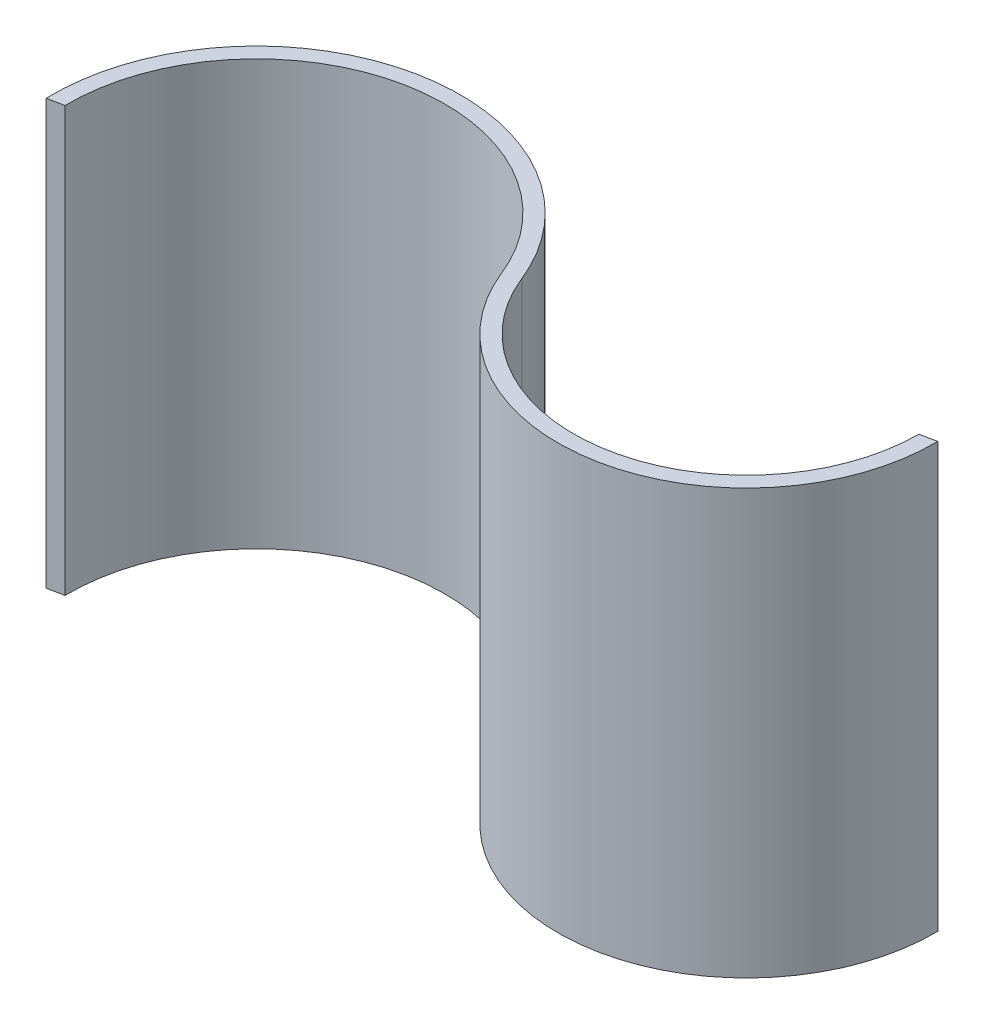
ISO-10303-21;
HEADER;
FILE_DESCRIPTION(('STEP AP214'),'2;1');
FILE_NAME('part.step','',(''),(''),'','','');
FILE_SCHEMA(('AUTOMOTIVE_DESIGN { 1 0 10303 214 1 1 1 1 }'));
ENDSEC;
DATA;
#1=APPLICATION_CONTEXT('core data for automotive mechanical design processes');
#2=APPLICATION_PROTOCOL_DEFINITION('international standard','automotive_design',2000,#1);
#3=PRODUCT_CONTEXT('',#1,'mechanical');
#4=PRODUCT('Part','Part','',(#3));
#5=PRODUCT_RELATED_PRODUCT_CATEGORY('part','',(#4));
#6=PRODUCT_DEFINITION_FORMATION('','',#4);
#7=PRODUCT_DEFINITION_CONTEXT('part definition',#1,'design');
#8=PRODUCT_DEFINITION('design','',#6,#7);
#9=PRODUCT_DEFINITION_SHAPE('','',#8);
#10=(LENGTH_UNIT() NAMED_UNIT(*) SI_UNIT(.MILLI.,.METRE.));
#11=(NAMED_UNIT(*) PLANE_ANGLE_UNIT() SI_UNIT($,.RADIAN.));
#12=(NAMED_UNIT(*) SI_UNIT($,.STERADIAN.) SOLID_ANGLE_UNIT());
#13=UNCERTAINTY_MEASURE_WITH_UNIT(LENGTH_MEASURE(1.E-05),#10,'distance_accuracy_value','');
#14=(GEOMETRIC_REPRESENTATION_CONTEXT(3) GLOBAL_UNCERTAINTY_ASSIGNED_CONTEXT((#13)) GLOBAL_UNIT_ASSIGNED_CONTEXT((#10,
#11,#12)) REPRESENTATION_CONTEXT('',''));
#15=CARTESIAN_POINT('',(0.,0.,0.));
#16=DIRECTION('',(0.,0.,1.));
#17=DIRECTION('',(1.,0.,0.));
#18=AXIS2_PLACEMENT_3D('',#15,#16,#17);
#19=CARTESIAN_POINT('',(-55.7086014531155,135.,22.2834405812462));
#20=DIRECTION('',(0.,-1.,0.));
#21=DIRECTION('',(0.,0.,-1.));
#22=AXIS2_PLACEMENT_3D('',#19,#20,#21);
#23=CYLINDRICAL_SURFACE('',#22,65.);
#24=CARTESIAN_POINT('',(-55.7086014531155,0.,22.2834405812462));
#25=DIRECTION('',(0.,1.,0.));
#26=DIRECTION('',(0.,0.,1.));
#27=AXIS2_PLACEMENT_3D('',#24,#25,#26);
#28=CIRCLE('',#27,65.);
#29=CARTESIAN_POINT('',(4.6423834544263,0.,-1.85695338177053));
#30=VERTEX_POINT('',#29);
#31=CARTESIAN_POINT('',(-120.682183816636,0.,24.1364367633272));
#32=VERTEX_POINT('',#31);
#33=EDGE_CURVE('E120',#30,#32,#28,.T.);
#34=ORIENTED_EDGE('',*,*,#33,.T.);
#35=DIRECTION('',(0.,-1.,0.));
#36=VECTOR('',#35,1.);
#37=CARTESIAN_POINT('',(-120.682183816636,135.,24.1364367633272));
#38=LINE('',#37,#36);
#39=CARTESIAN_POINT('',(-120.682183816636,135.,24.1364367633272));
#40=VERTEX_POINT('',#39);
#41=EDGE_CURVE('E11',#40,#32,#38,.T.);
#42=ORIENTED_EDGE('',*,*,#41,.F.);
#43=CARTESIAN_POINT('',(-55.7086014531155,135.,22.2834405812462));
#44=DIRECTION('',(0.,1.,0.));
#45=DIRECTION('',(0.,0.,1.));
#46=AXIS2_PLACEMENT_3D('',#43,#44,#45);
#47=CIRCLE('',#46,65.);
#48=CARTESIAN_POINT('',(4.6423834544263,135.,-1.85695338177053));
#49=VERTEX_POINT('',#48);
#50=EDGE_CURVE('E130',#49,#40,#47,.T.);
#51=ORIENTED_EDGE('',*,*,#50,.F.);
#52=DIRECTION('',(0.,-1.,0.));
#53=VECTOR('',#52,1.);
#54=CARTESIAN_POINT('',(4.6423834544263,135.,-1.85695338177053));
#55=LINE('',#54,#53);
#56=EDGE_CURVE('E116',#49,#30,#55,.T.);
#57=ORIENTED_EDGE('',*,*,#56,.T.);
#58=EDGE_LOOP('',(#34,#42,#51,#57));
#59=FACE_BOUND('',#58,.T.);
#60=ADVANCED_FACE('F36',(#59),#23,.T.);
#61=CARTESIAN_POINT('',(-120.682183816636,135.,24.1364367633272));
#62=DIRECTION('',(-0.196116135138184,0.,-0.98058067569092));
#63=DIRECTION('',(-0.98058067569092,0.,0.196116135138184));
#64=AXIS2_PLACEMENT_3D('',#61,#62,#63);
#65=PLANE('',#64);
#66=DIRECTION('',(0.98058067569092,0.,-0.196116135138184));
#67=VECTOR('',#66,1.);
#68=CARTESIAN_POINT('',(-120.682183816636,0.,24.1364367633272));
#69=LINE('',#68,#67);
#70=CARTESIAN_POINT('',(-115.702479941086,0.,23.1404959882172));
#71=VERTEX_POINT('',#70);
#72=EDGE_CURVE('E123',#32,#71,#69,.T.);
#73=ORIENTED_EDGE('',*,*,#72,.T.);
#74=DIRECTION('',(0.,-1.,0.));
#75=VECTOR('',#74,1.);
#76=CARTESIAN_POINT('',(-115.702479941086,135.,23.1404959882172));
#77=LINE('',#76,#75);
#78=CARTESIAN_POINT('',(-115.702479941086,135.,23.1404959882172));
#79=VERTEX_POINT('',#78);
#80=EDGE_CURVE('E44',#79,#71,#77,.T.);
#81=ORIENTED_EDGE('',*,*,#80,.F.);
#82=DIRECTION('',(0.98058067569092,0.,-0.196116135138184));
#83=VECTOR('',#82,1.);
#84=CARTESIAN_POINT('',(-120.682183816636,135.,24.1364367633272));
#85=LINE('',#84,#83);
#86=EDGE_CURVE('E89',#40,#79,#85,.T.);
#87=ORIENTED_EDGE('',*,*,#86,.F.);
#88=ORIENTED_EDGE('',*,*,#41,.T.);
#89=EDGE_LOOP('',(#73,#81,#87,#88));
#90=FACE_BOUND('',#89,.T.);
#91=ADVANCED_FACE('F154',(#90),#65,.F.);
#92=CARTESIAN_POINT('',(-55.7086014531155,135.,22.2834405812462));
#93=DIRECTION('',(0.,-1.,0.));
#94=DIRECTION('',(0.,0.,-1.));
#95=AXIS2_PLACEMENT_3D('',#92,#93,#94);
#96=CYLINDRICAL_SURFACE('',#95,60.);
#97=CARTESIAN_POINT('',(-55.7086014531155,0.,22.2834405812462));
#98=DIRECTION('',(0.,-1.,0.));
#99=DIRECTION('',(0.,0.,1.));
#100=AXIS2_PLACEMENT_3D('',#97,#98,#99);
#101=CIRCLE('',#100,60.);
#102=CARTESIAN_POINT('',(0.,0.,0.));
#103=VERTEX_POINT('',#102);
#104=EDGE_CURVE('E125',#71,#103,#101,.T.);
#105=ORIENTED_EDGE('',*,*,#104,.T.);
#106=DIRECTION('',(0.,-1.,0.));
#107=VECTOR('',#106,1.);
#108=CARTESIAN_POINT('',(0.,135.,0.));
#109=LINE('',#108,#107);
#110=CARTESIAN_POINT('',(0.,135.,0.));
#111=VERTEX_POINT('',#110);
#112=EDGE_CURVE('E111',#111,#103,#109,.T.);
#113=ORIENTED_EDGE('',*,*,#112,.F.);
#114=CARTESIAN_POINT('',(-55.7086014531155,135.,22.2834405812462));
#115=DIRECTION('',(0.,-1.,0.));
#116=DIRECTION('',(0.,0.,1.));
#117=AXIS2_PLACEMENT_3D('',#114,#115,#116);
#118=CIRCLE('',#117,60.);
#119=EDGE_CURVE('E102',#79,#111,#118,.T.);
#120=ORIENTED_EDGE('',*,*,#119,.F.);
#121=ORIENTED_EDGE('',*,*,#80,.T.);
#122=EDGE_LOOP('',(#105,#113,#120,#121));
#123=FACE_BOUND('',#122,.T.);
#124=ADVANCED_FACE('F136',(#123),#96,.F.);
#125=CARTESIAN_POINT('',(55.7086014531156,135.,-22.2834405812462));
#126=DIRECTION('',(0.,-1.,0.));
#127=DIRECTION('',(0.,0.,-1.));
#128=AXIS2_PLACEMENT_3D('',#125,#126,#127);
#129=CYLINDRICAL_SURFACE('',#128,60.);
#130=CARTESIAN_POINT('',(55.7086014531156,0.,-22.2834405812462));
#131=DIRECTION('',(0.,1.,0.));
#132=DIRECTION('',(0.,0.,1.));
#133=AXIS2_PLACEMENT_3D('',#130,#131,#132);
#134=CIRCLE('',#133,60.);
#135=CARTESIAN_POINT('',(115.702479941086,0.,-23.1404959882172));
#136=VERTEX_POINT('',#135);
#137=EDGE_CURVE('E110',#103,#136,#134,.T.);
#138=ORIENTED_EDGE('',*,*,#137,.T.);
#139=DIRECTION('',(0.,-1.,0.));
#140=VECTOR('',#139,1.);
#141=CARTESIAN_POINT('',(115.702479941086,135.,-23.1404959882172));
#142=LINE('',#141,#140);
#143=CARTESIAN_POINT('',(115.702479941086,135.,-23.1404959882172));
#144=VERTEX_POINT('',#143);
#145=EDGE_CURVE('E107',#144,#136,#142,.T.);
#146=ORIENTED_EDGE('',*,*,#145,.F.);
#147=CARTESIAN_POINT('',(55.7086014531156,135.,-22.2834405812462));
#148=DIRECTION('',(0.,1.,0.));
#149=DIRECTION('',(0.,0.,1.));
#150=AXIS2_PLACEMENT_3D('',#147,#148,#149);
#151=CIRCLE('',#150,60.);
#152=EDGE_CURVE('E96',#111,#144,#151,.T.);
#153=ORIENTED_EDGE('',*,*,#152,.F.);
#154=ORIENTED_EDGE('',*,*,#112,.T.);
#155=EDGE_LOOP('',(#138,#146,#153,#154));
#156=FACE_BOUND('',#155,.T.);
#157=ADVANCED_FACE('F108',(#156),#129,.T.);
#158=CARTESIAN_POINT('',(110.708418771012,135.,-22.1416837542024));
#159=DIRECTION('',(0.196116135138184,0.,0.98058067569092));
#160=DIRECTION('',(0.98058067569092,0.,-0.196116135138184));
#161=AXIS2_PLACEMENT_3D('',#158,#159,#160);
#162=PLANE('',#161);
#163=DIRECTION('',(-0.98058067569092,0.,0.196116135138183));
#164=VECTOR('',#163,1.);
#165=CARTESIAN_POINT('',(110.708418771012,0.,-22.1416837542024));
#166=LINE('',#165,#164);
#167=CARTESIAN_POINT('',(110.708418771012,0.,-22.1416837542024));
#168=VERTEX_POINT('',#167);
#169=EDGE_CURVE('E75',#136,#168,#166,.T.);
#170=ORIENTED_EDGE('',*,*,#169,.T.);
#171=DIRECTION('',(0.,-1.,0.));
#172=VECTOR('',#171,1.);
#173=CARTESIAN_POINT('',(110.708418771012,135.,-22.1416837542024));
#174=LINE('',#173,#172);
#175=CARTESIAN_POINT('',(110.708418771012,135.,-22.1416837542024));
#176=VERTEX_POINT('',#175);
#177=EDGE_CURVE('E112',#176,#168,#174,.T.);
#178=ORIENTED_EDGE('',*,*,#177,.F.);
#179=DIRECTION('',(-0.98058067569092,0.,0.196116135138183));
#180=VECTOR('',#179,1.);
#181=CARTESIAN_POINT('',(110.708418771012,135.,-22.1416837542024));
#182=LINE('',#181,#180);
#183=EDGE_CURVE('E100',#144,#176,#182,.T.);
#184=ORIENTED_EDGE('',*,*,#183,.F.);
#185=ORIENTED_EDGE('',*,*,#145,.T.);
#186=EDGE_LOOP('',(#170,#178,#184,#185));
#187=FACE_BOUND('',#186,.T.);
#188=ADVANCED_FACE('F114',(#187),#162,.F.);
#189=CARTESIAN_POINT('',(55.7086014531156,135.,-22.2834405812462));
#190=DIRECTION('',(0.,-1.,0.));
#191=DIRECTION('',(0.,0.,-1.));
#192=AXIS2_PLACEMENT_3D('',#189,#190,#191);
#193=CYLINDRICAL_SURFACE('',#192,55.);
#194=CARTESIAN_POINT('',(55.7086014531156,0.,-22.2834405812462));
#195=DIRECTION('',(0.,-1.,0.));
#196=DIRECTION('',(0.,0.,1.));
#197=AXIS2_PLACEMENT_3D('',#194,#195,#196);
#198=CIRCLE('',#197,55.);
#199=EDGE_CURVE('E81',#168,#30,#198,.T.);
#200=ORIENTED_EDGE('',*,*,#199,.T.);
#201=ORIENTED_EDGE('',*,*,#56,.F.);
#202=CARTESIAN_POINT('',(55.7086014531156,135.,-22.2834405812462));
#203=DIRECTION('',(0.,-1.,0.));
#204=DIRECTION('',(0.,0.,1.));
#205=AXIS2_PLACEMENT_3D('',#202,#203,#204);
#206=CIRCLE('',#205,55.);
#207=EDGE_CURVE('E52',#176,#49,#206,.T.);
#208=ORIENTED_EDGE('',*,*,#207,.F.);
#209=ORIENTED_EDGE('',*,*,#177,.T.);
#210=EDGE_LOOP('',(#200,#201,#208,#209));
#211=FACE_BOUND('',#210,.T.);
#212=ADVANCED_FACE('F143',(#211),#193,.F.);
#213=CARTESIAN_POINT('',(-55.7086014531155,135.,22.2834405812462));
#214=DIRECTION('',(0.,1.,0.));
#215=DIRECTION('',(0.,0.,1.));
#216=AXIS2_PLACEMENT_3D('',#213,#214,#215);
#217=PLANE('',#216);
#218=ORIENTED_EDGE('',*,*,#50,.T.);
#219=ORIENTED_EDGE('',*,*,#86,.T.);
#220=ORIENTED_EDGE('',*,*,#119,.T.);
#221=ORIENTED_EDGE('',*,*,#152,.T.);
#222=ORIENTED_EDGE('',*,*,#183,.T.);
#223=ORIENTED_EDGE('',*,*,#207,.T.);
#224=EDGE_LOOP('',(#218,#219,#220,#221,#222,#223));
#225=FACE_BOUND('',#224,.T.);
#226=ADVANCED_FACE('F98',(#225),#217,.T.);
#227=CARTESIAN_POINT('',(-55.7086014531155,0.,22.2834405812462));
#228=DIRECTION('',(0.,1.,0.));
#229=DIRECTION('',(0.,0.,1.));
#230=AXIS2_PLACEMENT_3D('',#227,#228,#229);
#231=PLANE('',#230);
#232=ORIENTED_EDGE('',*,*,#33,.F.);
#233=ORIENTED_EDGE('',*,*,#199,.F.);
#234=ORIENTED_EDGE('',*,*,#169,.F.);
#235=ORIENTED_EDGE('',*,*,#137,.F.);
#236=ORIENTED_EDGE('',*,*,#104,.F.);
#237=ORIENTED_EDGE('',*,*,#72,.F.);
#238=EDGE_LOOP('',(#232,#233,#234,#235,#236,#237));
#239=FACE_BOUND('',#238,.T.);
#240=ADVANCED_FACE('F139',(#239),#231,.F.);
#241=CLOSED_SHELL('',(#60,#91,#124,#157,#188,#212,#226,#240));
#242=MANIFOLD_SOLID_BREP('B2',#241);
#243=ADVANCED_BREP_SHAPE_REPRESENTATION('',(#18,#242),#14);
#244=SHAPE_DEFINITION_REPRESENTATION(#9,#243);
ENDSEC;
END-ISO-10303-21;
